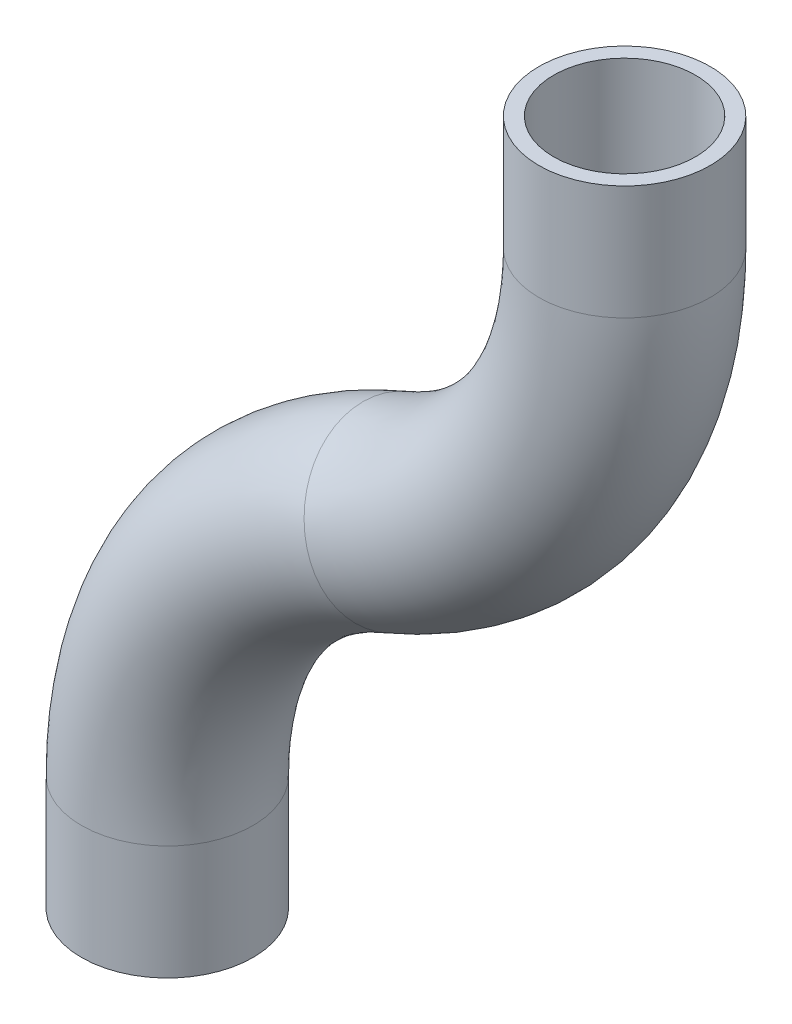
ISO-10303-21;
HEADER;
FILE_DESCRIPTION(('STEP AP214'),'2;1');
FILE_NAME('part.step','',(''),(''),'','','');
FILE_SCHEMA(('AUTOMOTIVE_DESIGN { 1 0 10303 214 1 1 1 1 }'));
ENDSEC;
DATA;
#1=APPLICATION_CONTEXT('core data for automotive mechanical design processes');
#2=APPLICATION_PROTOCOL_DEFINITION('international standard','automotive_design',2000,#1);
#3=PRODUCT_CONTEXT('',#1,'mechanical');
#4=PRODUCT('Part','Part','',(#3));
#5=PRODUCT_RELATED_PRODUCT_CATEGORY('part','',(#4));
#6=PRODUCT_DEFINITION_FORMATION('','',#4);
#7=PRODUCT_DEFINITION_CONTEXT('part definition',#1,'design');
#8=PRODUCT_DEFINITION('design','',#6,#7);
#9=PRODUCT_DEFINITION_SHAPE('','',#8);
#10=(LENGTH_UNIT() NAMED_UNIT(*) SI_UNIT(.MILLI.,.METRE.));
#11=(NAMED_UNIT(*) PLANE_ANGLE_UNIT() SI_UNIT($,.RADIAN.));
#12=(NAMED_UNIT(*) SI_UNIT($,.STERADIAN.) SOLID_ANGLE_UNIT());
#13=UNCERTAINTY_MEASURE_WITH_UNIT(LENGTH_MEASURE(1.E-05),#10,'distance_accuracy_value','');
#14=(GEOMETRIC_REPRESENTATION_CONTEXT(3) GLOBAL_UNCERTAINTY_ASSIGNED_CONTEXT((#13)) GLOBAL_UNIT_ASSIGNED_CONTEXT((#10,
#11,#12)) REPRESENTATION_CONTEXT('',''));
#15=CARTESIAN_POINT('',(0.,0.,0.));
#16=DIRECTION('',(0.,0.,1.));
#17=DIRECTION('',(1.,0.,0.));
#18=AXIS2_PLACEMENT_3D('',#15,#16,#17);
#19=CARTESIAN_POINT('',(0.,0.,0.));
#20=DIRECTION('',(0.,1.,0.));
#21=DIRECTION('',(0.,0.,1.));
#22=AXIS2_PLACEMENT_3D('',#19,#20,#21);
#23=CYLINDRICAL_SURFACE('',#22,9.525);
#24=CARTESIAN_POINT('',(0.,12.7,0.));
#25=DIRECTION('',(0.,1.,0.));
#26=DIRECTION('',(0.,0.,1.));
#27=AXIS2_PLACEMENT_3D('',#24,#25,#26);
#28=CIRCLE('',#27,9.525);
#29=CARTESIAN_POINT('',(-9.525,12.7,0.));
#30=VERTEX_POINT('',#29);
#31=EDGE_CURVE('E56',#30,#30,#28,.T.);
#32=ORIENTED_EDGE('',*,*,#31,.F.);
#33=EDGE_LOOP('',(#32));
#34=FACE_BOUND('',#33,.T.);
#35=CARTESIAN_POINT('',(0.,0.,0.));
#36=DIRECTION('',(0.,1.,0.));
#37=DIRECTION('',(0.,0.,1.));
#38=AXIS2_PLACEMENT_3D('',#35,#36,#37);
#39=CIRCLE('',#38,9.525);
#40=CARTESIAN_POINT('',(0.,0.,9.525));
#41=VERTEX_POINT('',#40);
#42=EDGE_CURVE('E53',#41,#41,#39,.T.);
#43=ORIENTED_EDGE('',*,*,#42,.T.);
#44=EDGE_LOOP('',(#43));
#45=FACE_BOUND('',#44,.T.);
#46=ADVANCED_FACE('F32',(#34,#45),#23,.T.);
#47=CARTESIAN_POINT('',(41.275,12.7,0.));
#48=DIRECTION('',(0.,0.,-1.));
#49=DIRECTION('',(-1.,0.,0.));
#50=AXIS2_PLACEMENT_3D('',#47,#48,#49);
#51=TOROIDAL_SURFACE('',#50,41.275,9.525);
#52=CARTESIAN_POINT('',(25.4,50.8,0.));
#53=DIRECTION('',(0.923076923076923,0.384615384615385,0.));
#54=DIRECTION('',(0.,0.,1.));
#55=AXIS2_PLACEMENT_3D('',#52,#53,#54);
#56=CIRCLE('',#55,9.525);
#57=CARTESIAN_POINT('',(21.7365384615385,59.5923076923077,0.));
#58=VERTEX_POINT('',#57);
#59=EDGE_CURVE('E58',#58,#58,#56,.T.);
#60=CARTESIAN_POINT('',(41.275,12.7,0.));
#61=DIRECTION('',(0.,0.,-1.));
#62=DIRECTION('',(-1.,0.,0.));
#63=AXIS2_PLACEMENT_3D('',#60,#61,#62);
#64=CIRCLE('',#63,50.8);
#65=EDGE_CURVE('',#30,#58,#64,.T.);
#66=ORIENTED_EDGE('',*,*,#31,.T.);
#67=ORIENTED_EDGE('',*,*,#59,.F.);
#68=ORIENTED_EDGE('',*,*,#65,.T.);
#69=ORIENTED_EDGE('',*,*,#65,.F.);
#70=EDGE_LOOP('',(#66,#68,#67,#69));
#71=FACE_BOUND('',#70,.T.);
#72=ADVANCED_FACE('F68',(#71),#51,.T.);
#73=CARTESIAN_POINT('',(9.525,88.9,0.));
#74=DIRECTION('',(0.,0.,1.));
#75=DIRECTION('',(1.,0.,0.));
#76=AXIS2_PLACEMENT_3D('',#73,#74,#75);
#77=TOROIDAL_SURFACE('',#76,41.275,9.525);
#78=CARTESIAN_POINT('',(50.8,88.9,0.));
#79=DIRECTION('',(0.,1.,0.));
#80=DIRECTION('',(0.,0.,1.));
#81=AXIS2_PLACEMENT_3D('',#78,#79,#80);
#82=CIRCLE('',#81,9.525);
#83=CARTESIAN_POINT('',(50.8,88.9,9.525));
#84=VERTEX_POINT('',#83);
#85=EDGE_CURVE('E36',#84,#84,#82,.T.);
#86=ORIENTED_EDGE('',*,*,#85,.F.);
#87=EDGE_LOOP('',(#86));
#88=FACE_BOUND('',#87,.T.);
#89=ORIENTED_EDGE('',*,*,#59,.T.);
#90=EDGE_LOOP('',(#89));
#91=FACE_BOUND('',#90,.T.);
#92=ADVANCED_FACE('F66',(#88,#91),#77,.T.);
#93=CARTESIAN_POINT('',(50.8,88.9,0.));
#94=DIRECTION('',(0.,1.,0.));
#95=DIRECTION('',(0.,0.,1.));
#96=AXIS2_PLACEMENT_3D('',#93,#94,#95);
#97=CYLINDRICAL_SURFACE('',#96,9.525);
#98=CARTESIAN_POINT('',(50.8,101.6,0.));
#99=DIRECTION('',(0.,1.,0.));
#100=DIRECTION('',(0.,0.,1.));
#101=AXIS2_PLACEMENT_3D('',#98,#99,#100);
#102=CIRCLE('',#101,9.525);
#103=CARTESIAN_POINT('',(50.8,101.6,9.525));
#104=VERTEX_POINT('',#103);
#105=EDGE_CURVE('E49',#104,#104,#102,.T.);
#106=ORIENTED_EDGE('',*,*,#105,.F.);
#107=EDGE_LOOP('',(#106));
#108=FACE_BOUND('',#107,.T.);
#109=ORIENTED_EDGE('',*,*,#85,.T.);
#110=EDGE_LOOP('',(#109));
#111=FACE_BOUND('',#110,.T.);
#112=ADVANCED_FACE('F34',(#108,#111),#97,.T.);
#113=CARTESIAN_POINT('',(0.,0.,0.));
#114=DIRECTION('',(0.,1.,0.));
#115=DIRECTION('',(0.,0.,1.));
#116=AXIS2_PLACEMENT_3D('',#113,#114,#115);
#117=PLANE('',#116);
#118=CARTESIAN_POINT('',(0.,0.,0.));
#119=DIRECTION('',(0.,1.,0.));
#120=DIRECTION('',(0.,0.,1.));
#121=AXIS2_PLACEMENT_3D('',#118,#119,#120);
#122=CIRCLE('',#121,7.874);
#123=CARTESIAN_POINT('',(0.,0.,7.874));
#124=VERTEX_POINT('',#123);
#125=EDGE_CURVE('E52',#124,#124,#122,.F.);
#126=ORIENTED_EDGE('',*,*,#125,.F.);
#127=EDGE_LOOP('',(#126));
#128=FACE_BOUND('',#127,.T.);
#129=ORIENTED_EDGE('',*,*,#42,.F.);
#130=EDGE_LOOP('',(#129));
#131=FACE_BOUND('',#130,.T.);
#132=ADVANCED_FACE('F73',(#128,#131),#117,.F.);
#133=CARTESIAN_POINT('',(50.8,101.6,0.));
#134=DIRECTION('',(0.,1.,0.));
#135=DIRECTION('',(0.,0.,1.));
#136=AXIS2_PLACEMENT_3D('',#133,#134,#135);
#137=PLANE('',#136);
#138=CARTESIAN_POINT('',(50.8,101.6,0.));
#139=DIRECTION('',(0.,1.,0.));
#140=DIRECTION('',(0.,0.,1.));
#141=AXIS2_PLACEMENT_3D('',#138,#139,#140);
#142=CIRCLE('',#141,7.874);
#143=CARTESIAN_POINT('',(50.8,101.6,7.874));
#144=VERTEX_POINT('',#143);
#145=EDGE_CURVE('E10',#144,#144,#142,.F.);
#146=ORIENTED_EDGE('',*,*,#145,.T.);
#147=EDGE_LOOP('',(#146));
#148=FACE_BOUND('',#147,.T.);
#149=ORIENTED_EDGE('',*,*,#105,.T.);
#150=EDGE_LOOP('',(#149));
#151=FACE_BOUND('',#150,.T.);
#152=ADVANCED_FACE('F91',(#148,#151),#137,.T.);
#153=CARTESIAN_POINT('',(0.,0.,0.));
#154=DIRECTION('',(0.,1.,0.));
#155=DIRECTION('',(0.,0.,1.));
#156=AXIS2_PLACEMENT_3D('',#153,#154,#155);
#157=CYLINDRICAL_SURFACE('',#156,7.874);
#158=CARTESIAN_POINT('',(0.,12.7,0.));
#159=DIRECTION('',(0.,1.,0.));
#160=DIRECTION('',(0.,0.,1.));
#161=AXIS2_PLACEMENT_3D('',#158,#159,#160);
#162=CIRCLE('',#161,7.874);
#163=CARTESIAN_POINT('',(-7.874,12.7,0.));
#164=VERTEX_POINT('',#163);
#165=EDGE_CURVE('E169',#164,#164,#162,.F.);
#166=ORIENTED_EDGE('',*,*,#165,.F.);
#167=EDGE_LOOP('',(#166));
#168=FACE_BOUND('',#167,.T.);
#169=ORIENTED_EDGE('',*,*,#125,.T.);
#170=EDGE_LOOP('',(#169));
#171=FACE_BOUND('',#170,.T.);
#172=ADVANCED_FACE('F94',(#168,#171),#157,.F.);
#173=CARTESIAN_POINT('',(41.275,12.7,0.));
#174=DIRECTION('',(0.,0.,-1.));
#175=DIRECTION('',(-1.,0.,0.));
#176=AXIS2_PLACEMENT_3D('',#173,#174,#175);
#177=TOROIDAL_SURFACE('',#176,41.275,7.874);
#178=CARTESIAN_POINT('',(25.4,50.8,0.));
#179=DIRECTION('',(0.923076923076923,0.384615384615385,0.));
#180=DIRECTION('',(0.,0.,1.));
#181=AXIS2_PLACEMENT_3D('',#178,#179,#180);
#182=CIRCLE('',#181,7.874);
#183=CARTESIAN_POINT('',(22.3715384615385,58.0683076923077,0.));
#184=VERTEX_POINT('',#183);
#185=EDGE_CURVE('E45',#184,#184,#182,.F.);
#186=CARTESIAN_POINT('',(41.275,12.7,0.));
#187=DIRECTION('',(0.,0.,-1.));
#188=DIRECTION('',(-1.,0.,0.));
#189=AXIS2_PLACEMENT_3D('',#186,#187,#188);
#190=CIRCLE('',#189,49.149);
#191=EDGE_CURVE('',#164,#184,#190,.T.);
#192=ORIENTED_EDGE('',*,*,#165,.T.);
#193=ORIENTED_EDGE('',*,*,#185,.F.);
#194=ORIENTED_EDGE('',*,*,#191,.T.);
#195=ORIENTED_EDGE('',*,*,#191,.F.);
#196=EDGE_LOOP('',(#192,#194,#193,#195));
#197=FACE_BOUND('',#196,.T.);
#198=ADVANCED_FACE('F85',(#197),#177,.F.);
#199=CARTESIAN_POINT('',(9.525,88.9,0.));
#200=DIRECTION('',(0.,0.,1.));
#201=DIRECTION('',(1.,0.,0.));
#202=AXIS2_PLACEMENT_3D('',#199,#200,#201);
#203=TOROIDAL_SURFACE('',#202,41.275,7.874);
#204=CARTESIAN_POINT('',(50.8,88.9,0.));
#205=DIRECTION('',(0.,1.,0.));
#206=DIRECTION('',(0.,0.,1.));
#207=AXIS2_PLACEMENT_3D('',#204,#205,#206);
#208=CIRCLE('',#207,7.874);
#209=CARTESIAN_POINT('',(50.8,88.9,7.874));
#210=VERTEX_POINT('',#209);
#211=EDGE_CURVE('E40',#210,#210,#208,.F.);
#212=ORIENTED_EDGE('',*,*,#211,.F.);
#213=EDGE_LOOP('',(#212));
#214=FACE_BOUND('',#213,.T.);
#215=ORIENTED_EDGE('',*,*,#185,.T.);
#216=EDGE_LOOP('',(#215));
#217=FACE_BOUND('',#216,.T.);
#218=ADVANCED_FACE('F79',(#214,#217),#203,.F.);
#219=CARTESIAN_POINT('',(50.8,88.9,0.));
#220=DIRECTION('',(0.,1.,0.));
#221=DIRECTION('',(0.,0.,1.));
#222=AXIS2_PLACEMENT_3D('',#219,#220,#221);
#223=CYLINDRICAL_SURFACE('',#222,7.874);
#224=ORIENTED_EDGE('',*,*,#145,.F.);
#225=EDGE_LOOP('',(#224));
#226=FACE_BOUND('',#225,.T.);
#227=ORIENTED_EDGE('',*,*,#211,.T.);
#228=EDGE_LOOP('',(#227));
#229=FACE_BOUND('',#228,.T.);
#230=ADVANCED_FACE('F77',(#226,#229),#223,.F.);
#231=CLOSED_SHELL('',(#46,#72,#92,#112,#132,#152,#172,#198,#218,#230));
#232=MANIFOLD_SOLID_BREP('B2',#231);
#233=ADVANCED_BREP_SHAPE_REPRESENTATION('',(#18,#232),#14);
#234=SHAPE_DEFINITION_REPRESENTATION(#9,#233);
ENDSEC;
END-ISO-10303-21;
